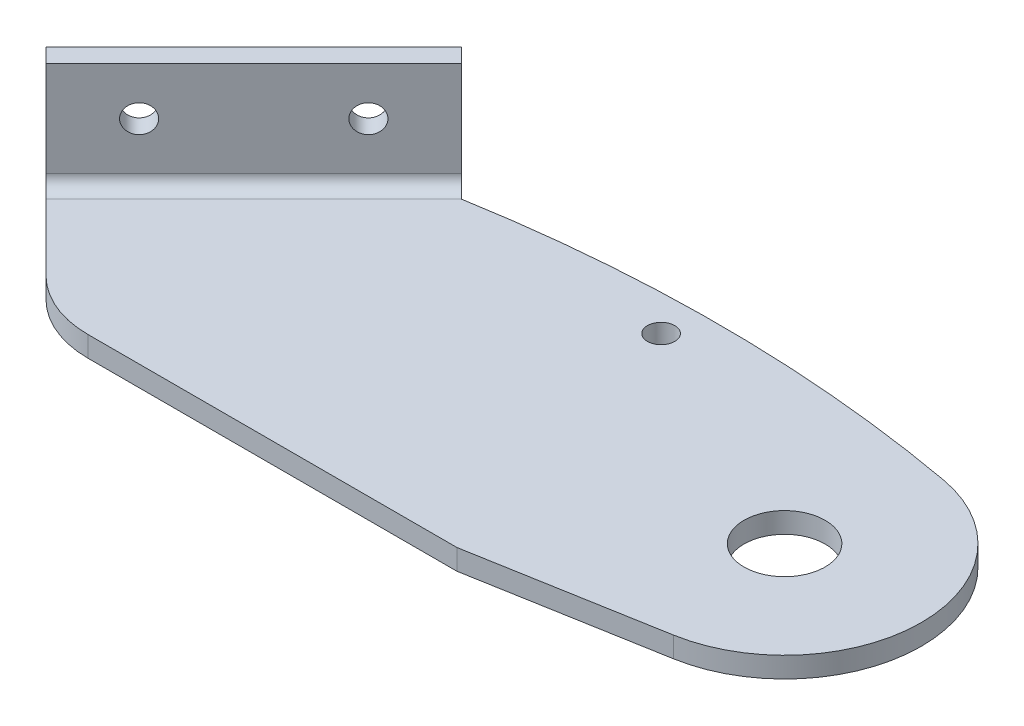
ISO-10303-21;
HEADER;
FILE_DESCRIPTION(('STEP AP214'),'2;1');
FILE_NAME('part.step','',(''),(''),'','','');
FILE_SCHEMA(('AUTOMOTIVE_DESIGN { 1 0 10303 214 1 1 1 1 }'));
ENDSEC;
DATA;
#1=APPLICATION_CONTEXT('core data for automotive mechanical design processes');
#2=APPLICATION_PROTOCOL_DEFINITION('international standard','automotive_design',2000,#1);
#3=PRODUCT_CONTEXT('',#1,'mechanical');
#4=PRODUCT('Part','Part','',(#3));
#5=PRODUCT_RELATED_PRODUCT_CATEGORY('part','',(#4));
#6=PRODUCT_DEFINITION_FORMATION('','',#4);
#7=PRODUCT_DEFINITION_CONTEXT('part definition',#1,'design');
#8=PRODUCT_DEFINITION('design','',#6,#7);
#9=PRODUCT_DEFINITION_SHAPE('','',#8);
#10=(LENGTH_UNIT() NAMED_UNIT(*) SI_UNIT(.MILLI.,.METRE.));
#11=(NAMED_UNIT(*) PLANE_ANGLE_UNIT() SI_UNIT($,.RADIAN.));
#12=(NAMED_UNIT(*) SI_UNIT($,.STERADIAN.) SOLID_ANGLE_UNIT());
#13=UNCERTAINTY_MEASURE_WITH_UNIT(LENGTH_MEASURE(1.E-05),#10,'distance_accuracy_value','');
#14=(GEOMETRIC_REPRESENTATION_CONTEXT(3) GLOBAL_UNCERTAINTY_ASSIGNED_CONTEXT((#13)) GLOBAL_UNIT_ASSIGNED_CONTEXT((#10,
#11,#12)) REPRESENTATION_CONTEXT('',''));
#15=CARTESIAN_POINT('',(0.,0.,0.));
#16=DIRECTION('',(0.,0.,1.));
#17=DIRECTION('',(1.,0.,0.));
#18=AXIS2_PLACEMENT_3D('',#15,#16,#17);
#19=CARTESIAN_POINT('',(14.5011314163777,7.968,-8.42031021678298));
#20=DIRECTION('',(-0.707106781186548,0.,-0.707106781186548));
#21=DIRECTION('',(-0.707106781186547,0.,0.707106781186548));
#22=AXIS2_PLACEMENT_3D('',#19,#20,#21);
#23=CYLINDRICAL_SURFACE('',#22,1.36525);
#24=CARTESIAN_POINT('',(11.6727042916315,7.968,-11.2487373415292));
#25=DIRECTION('',(-0.707106781186548,0.,-0.707106781186548));
#26=DIRECTION('',(-0.707106781186547,0.,0.707106781186548));
#27=AXIS2_PLACEMENT_3D('',#24,#25,#26);
#28=CIRCLE('',#27,1.36525);
#29=CARTESIAN_POINT('',(10.7073267586166,7.968,-10.2833598085142));
#30=VERTEX_POINT('',#29);
#31=EDGE_CURVE('E177',#30,#30,#28,.T.);
#32=ORIENTED_EDGE('',*,*,#31,.T.);
#33=EDGE_LOOP('',(#32));
#34=FACE_BOUND('',#33,.T.);
#35=CARTESIAN_POINT('',(13.1095452710026,7.968,-9.8118963621581));
#36=DIRECTION('',(-0.707106781186548,0.,-0.707106781186548));
#37=DIRECTION('',(-0.707106781186547,0.,0.707106781186548));
#38=AXIS2_PLACEMENT_3D('',#35,#36,#37);
#39=CIRCLE('',#38,1.36525);
#40=CARTESIAN_POINT('',(12.1441677379876,7.968,-8.84651882914316));
#41=VERTEX_POINT('',#40);
#42=EDGE_CURVE('E228',#41,#41,#39,.T.);
#43=ORIENTED_EDGE('',*,*,#42,.F.);
#44=EDGE_LOOP('',(#43));
#45=FACE_BOUND('',#44,.T.);
#46=ADVANCED_FACE('F50',(#34,#45),#23,.F.);
#47=CARTESIAN_POINT('',(3.18742291739294,7.968,2.89339828220179));
#48=DIRECTION('',(-0.707106781186548,0.,-0.707106781186548));
#49=DIRECTION('',(-0.707106781186547,0.,0.707106781186548));
#50=AXIS2_PLACEMENT_3D('',#47,#48,#49);
#51=CYLINDRICAL_SURFACE('',#50,1.36525);
#52=CARTESIAN_POINT('',(0.358995792646746,7.968,0.0649711574555981));
#53=DIRECTION('',(-0.707106781186548,0.,-0.707106781186548));
#54=DIRECTION('',(-0.707106781186547,0.,0.707106781186548));
#55=AXIS2_PLACEMENT_3D('',#52,#53,#54);
#56=CIRCLE('',#55,1.36525);
#57=CARTESIAN_POINT('',(-0.606381740368189,7.968,1.03034869047053));
#58=VERTEX_POINT('',#57);
#59=EDGE_CURVE('E247',#58,#58,#56,.T.);
#60=ORIENTED_EDGE('',*,*,#59,.T.);
#61=EDGE_LOOP('',(#60));
#62=FACE_BOUND('',#61,.T.);
#63=CARTESIAN_POINT('',(1.79583677201781,7.968,1.50181213682666));
#64=DIRECTION('',(-0.707106781186548,0.,-0.707106781186548));
#65=DIRECTION('',(-0.707106781186547,0.,0.707106781186548));
#66=AXIS2_PLACEMENT_3D('',#63,#64,#65);
#67=CIRCLE('',#66,1.36525);
#68=CARTESIAN_POINT('',(0.830459239002879,7.968,2.4671896698416));
#69=VERTEX_POINT('',#68);
#70=EDGE_CURVE('E233',#69,#69,#67,.T.);
#71=ORIENTED_EDGE('',*,*,#70,.F.);
#72=EDGE_LOOP('',(#71));
#73=FACE_BOUND('',#72,.T.);
#74=ADVANCED_FACE('F266',(#62,#73),#51,.F.);
#75=CARTESIAN_POINT('',(70.5718707373462,12.668,38.4580409487604));
#76=DIRECTION('',(0.,1.,0.));
#77=DIRECTION('',(-0.707106781186548,0.,0.707106781186548));
#78=AXIS2_PLACEMENT_3D('',#75,#76,#77);
#79=PLANE('',#78);
#80=DIRECTION('',(-0.707106781186548,0.,-0.707106781186548));
#81=VECTOR('',#80,1.);
#82=CARTESIAN_POINT('',(70.5718707373462,12.668,38.4580409487604));
#83=LINE('',#82,#81);
#84=CARTESIAN_POINT('',(17.7057393487151,12.668,-14.4080904398707));
#85=VERTEX_POINT('',#84);
#86=CARTESIAN_POINT('',(16.2688983693441,12.668,-15.8449314192417));
#87=VERTEX_POINT('',#86);
#88=EDGE_CURVE('E245',#85,#87,#83,.T.);
#89=ORIENTED_EDGE('',*,*,#88,.T.);
#90=DIRECTION('',(-0.707106781186547,0.,0.707106781186548));
#91=VECTOR('',#90,1.);
#92=CARTESIAN_POINT('',(16.2688983693441,12.668,-15.8449314192417));
#93=LINE('',#92,#91);
#94=CARTESIAN_POINT('',(-4.23719828506581,12.668,4.66116523516815));
#95=VERTEX_POINT('',#94);
#96=EDGE_CURVE('E158',#87,#95,#93,.T.);
#97=ORIENTED_EDGE('',*,*,#96,.T.);
#98=DIRECTION('',(-0.707106781186548,0.,-0.707106781186548));
#99=VECTOR('',#98,1.);
#100=CARTESIAN_POINT('',(50.0657740829363,12.668,58.9641376031703));
#101=LINE('',#100,#99);
#102=CARTESIAN_POINT('',(-2.80035730569474,12.668,6.09800621453923));
#103=VERTEX_POINT('',#102);
#104=EDGE_CURVE('E236',#103,#95,#101,.T.);
#105=ORIENTED_EDGE('',*,*,#104,.F.);
#106=DIRECTION('',(0.707106781186547,0.,-0.707106781186548));
#107=VECTOR('',#106,1.);
#108=CARTESIAN_POINT('',(17.7057393487151,12.668,-14.4080904398707));
#109=LINE('',#108,#107);
#110=EDGE_CURVE('E69',#103,#85,#109,.T.);
#111=ORIENTED_EDGE('',*,*,#110,.T.);
#112=EDGE_LOOP('',(#89,#97,#105,#111));
#113=FACE_BOUND('',#112,.T.);
#114=ADVANCED_FACE('F263',(#113),#79,.T.);
#115=CARTESIAN_POINT('',(70.5718707373462,12.668,38.4580409487604));
#116=DIRECTION('',(0.707106781186548,0.,-0.707106781186548));
#117=DIRECTION('',(0.,1.,0.));
#118=AXIS2_PLACEMENT_3D('',#115,#116,#117);
#119=PLANE('',#118);
#120=DIRECTION('',(-0.707106781186548,0.,-0.707106781186548));
#121=VECTOR('',#120,1.);
#122=CARTESIAN_POINT('',(70.5718707373462,3.27,38.4580409487604));
#123=LINE('',#122,#121);
#124=CARTESIAN_POINT('',(17.7057393487151,3.27000000000001,-14.4080904398707));
#125=VERTEX_POINT('',#124);
#126=CARTESIAN_POINT('',(16.268898369344,3.27000000000001,-15.8449314192417));
#127=VERTEX_POINT('',#126);
#128=EDGE_CURVE('E160',#125,#127,#123,.T.);
#129=ORIENTED_EDGE('',*,*,#128,.T.);
#130=DIRECTION('',(0.,1.,0.));
#131=VECTOR('',#130,1.);
#132=CARTESIAN_POINT('',(16.2688983693441,-0.0320000000000012,-15.8449314192417));
#133=LINE('',#132,#131);
#134=EDGE_CURVE('E94',#127,#87,#133,.T.);
#135=ORIENTED_EDGE('',*,*,#134,.T.);
#136=ORIENTED_EDGE('',*,*,#88,.F.);
#137=DIRECTION('',(0.,-1.,0.));
#138=VECTOR('',#137,1.);
#139=CARTESIAN_POINT('',(17.7057393487151,12.668,-14.4080904398707));
#140=LINE('',#139,#138);
#141=EDGE_CURVE('E159',#85,#125,#140,.T.);
#142=ORIENTED_EDGE('',*,*,#141,.T.);
#143=EDGE_LOOP('',(#129,#135,#136,#142));
#144=FACE_BOUND('',#143,.T.);
#145=ADVANCED_FACE('F164',(#144),#119,.T.);
#146=CARTESIAN_POINT('',(16.2688983693441,-0.0320000000000012,-15.8449314192417));
#147=DIRECTION('',(-0.707106781186547,0.,-0.707106781186548));
#148=DIRECTION('',(-0.707106781186548,0.,0.707106781186548));
#149=AXIS2_PLACEMENT_3D('',#146,#147,#148);
#150=PLANE('',#149);
#151=DIRECTION('',(0.707106781186548,0.,-0.707106781186547));
#152=VECTOR('',#151,1.);
#153=CARTESIAN_POINT('',(16.2688983693441,3.27,-15.8449314192417));
#154=LINE('',#153,#152);
#155=CARTESIAN_POINT('',(-4.23719828506581,3.27,4.66116523516816));
#156=VERTEX_POINT('',#155);
#157=EDGE_CURVE('E88',#156,#127,#154,.T.);
#158=ORIENTED_EDGE('',*,*,#157,.F.);
#159=DIRECTION('',(0.,1.,0.));
#160=VECTOR('',#159,1.);
#161=CARTESIAN_POINT('',(-4.23719828506581,12.668,4.66116523516816));
#162=LINE('',#161,#160);
#163=EDGE_CURVE('E238',#156,#95,#162,.T.);
#164=ORIENTED_EDGE('',*,*,#163,.T.);
#165=ORIENTED_EDGE('',*,*,#96,.F.);
#166=ORIENTED_EDGE('',*,*,#134,.F.);
#167=EDGE_LOOP('',(#158,#164,#165,#166));
#168=FACE_BOUND('',#167,.T.);
#169=ORIENTED_EDGE('',*,*,#59,.F.);
#170=EDGE_LOOP('',(#169));
#171=FACE_BOUND('',#170,.T.);
#172=ORIENTED_EDGE('',*,*,#31,.F.);
#173=EDGE_LOOP('',(#172));
#174=FACE_BOUND('',#173,.T.);
#175=ADVANCED_FACE('F155',(#168,#171,#174),#150,.T.);
#176=CARTESIAN_POINT('',(50.0657740829363,12.668,58.9641376031703));
#177=DIRECTION('',(0.707106781186548,0.,-0.707106781186548));
#178=DIRECTION('',(0.,1.,0.));
#179=AXIS2_PLACEMENT_3D('',#176,#177,#178);
#180=PLANE('',#179);
#181=ORIENTED_EDGE('',*,*,#163,.F.);
#182=DIRECTION('',(-0.707106781186548,0.,-0.707106781186548));
#183=VECTOR('',#182,1.);
#184=CARTESIAN_POINT('',(50.0657740829363,3.27,58.9641376031703));
#185=LINE('',#184,#183);
#186=CARTESIAN_POINT('',(-2.80035730569475,3.27,6.09800621453922));
#187=VERTEX_POINT('',#186);
#188=EDGE_CURVE('E54',#187,#156,#185,.T.);
#189=ORIENTED_EDGE('',*,*,#188,.F.);
#190=DIRECTION('',(0.,-1.,0.));
#191=VECTOR('',#190,1.);
#192=CARTESIAN_POINT('',(-2.80035730569474,12.668,6.09800621453922));
#193=LINE('',#192,#191);
#194=EDGE_CURVE('E60',#103,#187,#193,.T.);
#195=ORIENTED_EDGE('',*,*,#194,.F.);
#196=ORIENTED_EDGE('',*,*,#104,.T.);
#197=EDGE_LOOP('',(#181,#189,#195,#196));
#198=FACE_BOUND('',#197,.T.);
#199=ADVANCED_FACE('F256',(#198),#180,.F.);
#200=CARTESIAN_POINT('',(17.7057393487151,12.668,-14.4080904398707));
#201=DIRECTION('',(-0.707106781186548,0.,-0.707106781186548));
#202=DIRECTION('',(-0.707106781186547,0.,0.707106781186548));
#203=AXIS2_PLACEMENT_3D('',#200,#201,#202);
#204=PLANE('',#203);
#205=ORIENTED_EDGE('',*,*,#70,.T.);
#206=EDGE_LOOP('',(#205));
#207=FACE_BOUND('',#206,.T.);
#208=ORIENTED_EDGE('',*,*,#42,.T.);
#209=EDGE_LOOP('',(#208));
#210=FACE_BOUND('',#209,.T.);
#211=ORIENTED_EDGE('',*,*,#194,.T.);
#212=DIRECTION('',(0.707106781186548,0.,-0.707106781186548));
#213=VECTOR('',#212,1.);
#214=CARTESIAN_POINT('',(17.7057393487151,3.27,-14.4080904398706));
#215=LINE('',#214,#213);
#216=EDGE_CURVE('E13',#187,#125,#215,.T.);
#217=ORIENTED_EDGE('',*,*,#216,.T.);
#218=ORIENTED_EDGE('',*,*,#141,.F.);
#219=ORIENTED_EDGE('',*,*,#110,.F.);
#220=EDGE_LOOP('',(#211,#217,#218,#219));
#221=FACE_BOUND('',#220,.T.);
#222=ADVANCED_FACE('F52',(#207,#210,#221),#204,.F.);
#223=CARTESIAN_POINT('',(64.,-0.0319999999999999,0.));
#224=DIRECTION('',(0.,1.,0.));
#225=DIRECTION('',(0.,0.,1.));
#226=AXIS2_PLACEMENT_3D('',#223,#224,#225);
#227=PLANE('',#226);
#228=CARTESIAN_POINT('',(64.,-0.0319999999999999,0.));
#229=DIRECTION('',(0.,1.,0.));
#230=DIRECTION('',(0.,0.,-1.));
#231=AXIS2_PLACEMENT_3D('',#228,#229,#230);
#232=CIRCLE('',#231,4.);
#233=CARTESIAN_POINT('',(64.,-0.0319999999999999,-4.));
#234=VERTEX_POINT('',#233);
#235=EDGE_CURVE('E341',#234,#234,#232,.T.);
#236=ORIENTED_EDGE('',*,*,#235,.T.);
#237=EDGE_LOOP('',(#236));
#238=FACE_BOUND('',#237,.T.);
#239=CARTESIAN_POINT('',(39.9467553839433,-0.0319999999999999,-11.8675875071896));
#240=DIRECTION('',(0.,1.,0.));
#241=DIRECTION('',(0.,0.,1.));
#242=AXIS2_PLACEMENT_3D('',#239,#240,#241);
#243=CIRCLE('',#242,1.35255);
#244=CARTESIAN_POINT('',(39.9467553839433,-0.0319999999999999,-10.5150375071896));
#245=VERTEX_POINT('',#244);
#246=EDGE_CURVE('E338',#245,#245,#243,.T.);
#247=ORIENTED_EDGE('',*,*,#246,.T.);
#248=EDGE_LOOP('',(#247));
#249=FACE_BOUND('',#248,.T.);
#250=DIRECTION('',(-0.707106781186547,0.,0.707106781186548));
#251=VECTOR('',#250,1.);
#252=CARTESIAN_POINT('',(18.603764960822,-0.0320000000000042,-13.5100648277637));
#253=LINE('',#252,#251);
#254=CARTESIAN_POINT('',(18.603764960822,-0.0320000000000008,-13.5100648277637));
#255=VERTEX_POINT('',#254);
#256=CARTESIAN_POINT('',(-1.90233169358783,-0.031999999999999,6.99603182664614));
#257=VERTEX_POINT('',#256);
#258=EDGE_CURVE('E205',#255,#257,#253,.T.);
#259=ORIENTED_EDGE('',*,*,#258,.F.);
#260=DIRECTION('',(-0.707106781186547,0.,-0.707106781186548));
#261=VECTOR('',#260,1.);
#262=CARTESIAN_POINT('',(18.6138297885858,-0.0319999999999999,-13.5));
#263=LINE('',#262,#261);
#264=CARTESIAN_POINT('',(18.6138297885858,-0.0320000000000042,-13.5));
#265=VERTEX_POINT('',#264);
#266=EDGE_CURVE('E303',#265,#255,#263,.T.);
#267=ORIENTED_EDGE('',*,*,#266,.F.);
#268=CARTESIAN_POINT('',(41.9018097680888,-0.0319999999999999,121.082502881433));
#269=DIRECTION('',(0.,1.,0.));
#270=DIRECTION('',(0.,0.,-1.));
#271=AXIS2_PLACEMENT_3D('',#268,#269,#270);
#272=CIRCLE('',#271,136.582502881433);
#273=CARTESIAN_POINT('',(66.423785356544,-0.0319999999999999,-13.2806349451148));
#274=VERTEX_POINT('',#273);
#275=EDGE_CURVE('E306',#274,#265,#272,.T.);
#276=ORIENTED_EDGE('',*,*,#275,.F.);
#277=CARTESIAN_POINT('',(64.,-0.0319999999999999,0.));
#278=DIRECTION('',(0.,1.,0.));
#279=DIRECTION('',(0.,0.,1.));
#280=AXIS2_PLACEMENT_3D('',#277,#278,#279);
#281=CIRCLE('',#280,13.5);
#282=CARTESIAN_POINT('',(66.3442503985036,-0.0319999999999999,13.2949046656648));
#283=VERTEX_POINT('',#282);
#284=EDGE_CURVE('E309',#283,#274,#281,.T.);
#285=ORIENTED_EDGE('',*,*,#284,.F.);
#286=DIRECTION('',(0.984807753012208,0.,-0.173648177666931));
#287=VECTOR('',#286,1.);
#288=CARTESIAN_POINT('',(48.167251498747,-0.0319999999999999,16.5));
#289=LINE('',#288,#287);
#290=CARTESIAN_POINT('',(48.167251498747,-0.0319999999999999,16.5));
#291=VERTEX_POINT('',#290);
#292=EDGE_CURVE('E200',#291,#283,#289,.T.);
#293=ORIENTED_EDGE('',*,*,#292,.F.);
#294=DIRECTION('',(1.,0.,0.));
#295=VECTOR('',#294,1.);
#296=CARTESIAN_POINT('',(7.60163647976604,-0.0319999999999999,16.5));
#297=LINE('',#296,#295);
#298=CARTESIAN_POINT('',(11.743772103497,-0.0319999999999999,16.5));
#299=VERTEX_POINT('',#298);
#300=EDGE_CURVE('E344',#299,#291,#297,.T.);
#301=ORIENTED_EDGE('',*,*,#300,.F.);
#302=CARTESIAN_POINT('',(11.743772103497,-0.0319999999999999,6.5));
#303=DIRECTION('',(0.,1.,0.));
#304=DIRECTION('',(0.,0.,1.));
#305=AXIS2_PLACEMENT_3D('',#302,#303,#304);
#306=CIRCLE('',#305,10.);
#307=CARTESIAN_POINT('',(4.67270429163152,-0.0319999999999999,13.5710678118655));
#308=VERTEX_POINT('',#307);
#309=EDGE_CURVE('E311',#299,#308,#306,.F.);
#310=ORIENTED_EDGE('',*,*,#309,.T.);
#311=DIRECTION('',(0.707106781186548,0.,0.707106781186547));
#312=VECTOR('',#311,1.);
#313=CARTESIAN_POINT('',(-4.23719828506582,-0.0319999999999999,4.66116523516815));
#314=LINE('',#313,#312);
#315=EDGE_CURVE('E307',#257,#308,#314,.T.);
#316=ORIENTED_EDGE('',*,*,#315,.F.);
#317=EDGE_LOOP('',(#259,#267,#276,#285,#293,#301,#310,#316));
#318=FACE_BOUND('',#317,.T.);
#319=ADVANCED_FACE('F347',(#238,#249,#318),#227,.F.);
#320=CARTESIAN_POINT('',(64.,2.,0.));
#321=DIRECTION('',(0.,1.,0.));
#322=DIRECTION('',(0.,0.,1.));
#323=AXIS2_PLACEMENT_3D('',#320,#321,#322);
#324=PLANE('',#323);
#325=CARTESIAN_POINT('',(39.9467553839433,2.,-11.8675875071896));
#326=DIRECTION('',(0.,1.,0.));
#327=DIRECTION('',(0.,0.,1.));
#328=AXIS2_PLACEMENT_3D('',#325,#326,#327);
#329=CIRCLE('',#328,1.35255);
#330=CARTESIAN_POINT('',(39.9467553839433,2.,-10.5150375071896));
#331=VERTEX_POINT('',#330);
#332=EDGE_CURVE('E183',#331,#331,#329,.T.);
#333=ORIENTED_EDGE('',*,*,#332,.F.);
#334=EDGE_LOOP('',(#333));
#335=FACE_BOUND('',#334,.T.);
#336=CARTESIAN_POINT('',(64.,2.,0.));
#337=DIRECTION('',(0.,1.,0.));
#338=DIRECTION('',(0.,0.,-1.));
#339=AXIS2_PLACEMENT_3D('',#336,#337,#338);
#340=CIRCLE('',#339,4.);
#341=CARTESIAN_POINT('',(64.,2.,-4.));
#342=VERTEX_POINT('',#341);
#343=EDGE_CURVE('E333',#342,#342,#340,.T.);
#344=ORIENTED_EDGE('',*,*,#343,.F.);
#345=EDGE_LOOP('',(#344));
#346=FACE_BOUND('',#345,.T.);
#347=DIRECTION('',(-0.707106781186547,0.,-0.707106781186548));
#348=VECTOR('',#347,1.);
#349=CARTESIAN_POINT('',(18.6138297885858,2.,-13.5));
#350=LINE('',#349,#348);
#351=CARTESIAN_POINT('',(18.6138297885858,2.,-13.5));
#352=VERTEX_POINT('',#351);
#353=CARTESIAN_POINT('',(18.603764960822,2.,-13.5100648277637));
#354=VERTEX_POINT('',#353);
#355=EDGE_CURVE('E300',#352,#354,#350,.T.);
#356=ORIENTED_EDGE('',*,*,#355,.T.);
#357=DIRECTION('',(-0.707106781186547,0.,0.707106781186548));
#358=VECTOR('',#357,1.);
#359=CARTESIAN_POINT('',(18.603764960822,2.,-13.5100648277637));
#360=LINE('',#359,#358);
#361=CARTESIAN_POINT('',(-1.90233169358783,2.,6.99603182664614));
#362=VERTEX_POINT('',#361);
#363=EDGE_CURVE('E202',#354,#362,#360,.T.);
#364=ORIENTED_EDGE('',*,*,#363,.T.);
#365=DIRECTION('',(0.707106781186548,0.,0.707106781186547));
#366=VECTOR('',#365,1.);
#367=CARTESIAN_POINT('',(-4.23719828506582,2.,4.66116523516815));
#368=LINE('',#367,#366);
#369=CARTESIAN_POINT('',(4.67270429163152,2.,13.5710678118655));
#370=VERTEX_POINT('',#369);
#371=EDGE_CURVE('E192',#362,#370,#368,.T.);
#372=ORIENTED_EDGE('',*,*,#371,.T.);
#373=CARTESIAN_POINT('',(11.743772103497,2.,6.5));
#374=DIRECTION('',(0.,1.,0.));
#375=DIRECTION('',(0.,0.,1.));
#376=AXIS2_PLACEMENT_3D('',#373,#374,#375);
#377=CIRCLE('',#376,10.);
#378=CARTESIAN_POINT('',(11.743772103497,2.,16.5));
#379=VERTEX_POINT('',#378);
#380=EDGE_CURVE('E102',#370,#379,#377,.T.);
#381=ORIENTED_EDGE('',*,*,#380,.T.);
#382=DIRECTION('',(1.,0.,0.));
#383=VECTOR('',#382,1.);
#384=CARTESIAN_POINT('',(7.60163647976604,2.,16.5));
#385=LINE('',#384,#383);
#386=CARTESIAN_POINT('',(48.167251498747,2.,16.5));
#387=VERTEX_POINT('',#386);
#388=EDGE_CURVE('E110',#379,#387,#385,.T.);
#389=ORIENTED_EDGE('',*,*,#388,.T.);
#390=DIRECTION('',(0.984807753012208,0.,-0.173648177666931));
#391=VECTOR('',#390,1.);
#392=CARTESIAN_POINT('',(48.167251498747,2.,16.5));
#393=LINE('',#392,#391);
#394=CARTESIAN_POINT('',(66.3442503985036,2.,13.2949046656648));
#395=VERTEX_POINT('',#394);
#396=EDGE_CURVE('E327',#387,#395,#393,.T.);
#397=ORIENTED_EDGE('',*,*,#396,.T.);
#398=CARTESIAN_POINT('',(64.,2.,0.));
#399=DIRECTION('',(0.,1.,0.));
#400=DIRECTION('',(0.,0.,1.));
#401=AXIS2_PLACEMENT_3D('',#398,#399,#400);
#402=CIRCLE('',#401,13.5);
#403=CARTESIAN_POINT('',(66.423785356544,2.,-13.2806349451148));
#404=VERTEX_POINT('',#403);
#405=EDGE_CURVE('E325',#395,#404,#402,.T.);
#406=ORIENTED_EDGE('',*,*,#405,.T.);
#407=CARTESIAN_POINT('',(41.9018097680888,2.,121.082502881433));
#408=DIRECTION('',(0.,1.,0.));
#409=DIRECTION('',(0.,0.,-1.));
#410=AXIS2_PLACEMENT_3D('',#407,#408,#409);
#411=CIRCLE('',#410,136.582502881433);
#412=EDGE_CURVE('E326',#404,#352,#411,.T.);
#413=ORIENTED_EDGE('',*,*,#412,.T.);
#414=EDGE_LOOP('',(#356,#364,#372,#381,#389,#397,#406,#413));
#415=FACE_BOUND('',#414,.T.);
#416=ADVANCED_FACE('F297',(#335,#346,#415),#324,.T.);
#417=CARTESIAN_POINT('',(64.,-0.0319999999999999,0.));
#418=DIRECTION('',(0.,1.,0.));
#419=DIRECTION('',(0.,0.,1.));
#420=AXIS2_PLACEMENT_3D('',#417,#418,#419);
#421=CYLINDRICAL_SURFACE('',#420,4.);
#422=ORIENTED_EDGE('',*,*,#235,.F.);
#423=EDGE_LOOP('',(#422));
#424=FACE_BOUND('',#423,.T.);
#425=ORIENTED_EDGE('',*,*,#343,.T.);
#426=EDGE_LOOP('',(#425));
#427=FACE_BOUND('',#426,.T.);
#428=ADVANCED_FACE('F366',(#424,#427),#421,.F.);
#429=CARTESIAN_POINT('',(39.9467553839433,-1.,-11.8675875071896));
#430=DIRECTION('',(0.,1.,0.));
#431=DIRECTION('',(0.,0.,1.));
#432=AXIS2_PLACEMENT_3D('',#429,#430,#431);
#433=CYLINDRICAL_SURFACE('',#432,1.35255);
#434=ORIENTED_EDGE('',*,*,#332,.T.);
#435=EDGE_LOOP('',(#434));
#436=FACE_BOUND('',#435,.T.);
#437=ORIENTED_EDGE('',*,*,#246,.F.);
#438=EDGE_LOOP('',(#437));
#439=FACE_BOUND('',#438,.T.);
#440=ADVANCED_FACE('F369',(#436,#439),#433,.F.);
#441=CARTESIAN_POINT('',(18.6138297885858,171.184007176649,-13.5));
#442=DIRECTION('',(-0.707106781186548,0.,0.707106781186547));
#443=DIRECTION('',(0.707106781186547,0.,0.707106781186548));
#444=AXIS2_PLACEMENT_3D('',#441,#442,#443);
#445=PLANE('',#444);
#446=DIRECTION('',(0.,-1.,0.));
#447=VECTOR('',#446,1.);
#448=CARTESIAN_POINT('',(18.6138297885858,171.184007176649,-13.5));
#449=LINE('',#448,#447);
#450=EDGE_CURVE('E207',#352,#265,#449,.T.);
#451=ORIENTED_EDGE('',*,*,#450,.T.);
#452=ORIENTED_EDGE('',*,*,#266,.T.);
#453=DIRECTION('',(0.,-1.,0.));
#454=VECTOR('',#453,1.);
#455=CARTESIAN_POINT('',(18.603764960822,171.184007176649,-13.5100648277637));
#456=LINE('',#455,#454);
#457=EDGE_CURVE('E180',#354,#255,#456,.T.);
#458=ORIENTED_EDGE('',*,*,#457,.F.);
#459=ORIENTED_EDGE('',*,*,#355,.F.);
#460=EDGE_LOOP('',(#451,#452,#458,#459));
#461=FACE_BOUND('',#460,.T.);
#462=ADVANCED_FACE('F274',(#461),#445,.F.);
#463=CARTESIAN_POINT('',(-4.23719828506582,171.184007176649,4.66116523516815));
#464=DIRECTION('',(0.707106781186547,0.,-0.707106781186548));
#465=DIRECTION('',(-0.707106781186548,0.,-0.707106781186547));
#466=AXIS2_PLACEMENT_3D('',#463,#464,#465);
#467=PLANE('',#466);
#468=DIRECTION('',(0.,-1.,0.));
#469=VECTOR('',#468,1.);
#470=CARTESIAN_POINT('',(-1.90233169358783,171.184007176649,6.99603182664614));
#471=LINE('',#470,#469);
#472=EDGE_CURVE('E223',#362,#257,#471,.T.);
#473=ORIENTED_EDGE('',*,*,#472,.T.);
#474=ORIENTED_EDGE('',*,*,#315,.T.);
#475=DIRECTION('',(0.,-1.,0.));
#476=VECTOR('',#475,1.);
#477=CARTESIAN_POINT('',(4.67270429163152,171.184007176649,13.5710678118655));
#478=LINE('',#477,#476);
#479=EDGE_CURVE('E221',#370,#308,#478,.T.);
#480=ORIENTED_EDGE('',*,*,#479,.F.);
#481=ORIENTED_EDGE('',*,*,#371,.F.);
#482=EDGE_LOOP('',(#473,#474,#480,#481));
#483=FACE_BOUND('',#482,.T.);
#484=ADVANCED_FACE('F294',(#483),#467,.F.);
#485=CARTESIAN_POINT('',(11.743772103497,171.184007176649,6.5));
#486=DIRECTION('',(0.,-1.,0.));
#487=DIRECTION('',(0.,0.,-1.));
#488=AXIS2_PLACEMENT_3D('',#485,#486,#487);
#489=CYLINDRICAL_SURFACE('',#488,10.);
#490=ORIENTED_EDGE('',*,*,#479,.T.);
#491=ORIENTED_EDGE('',*,*,#309,.F.);
#492=DIRECTION('',(0.,-1.,0.));
#493=VECTOR('',#492,1.);
#494=CARTESIAN_POINT('',(11.743772103497,171.184007176649,16.5));
#495=LINE('',#494,#493);
#496=EDGE_CURVE('E219',#379,#299,#495,.T.);
#497=ORIENTED_EDGE('',*,*,#496,.F.);
#498=ORIENTED_EDGE('',*,*,#380,.F.);
#499=EDGE_LOOP('',(#490,#491,#497,#498));
#500=FACE_BOUND('',#499,.T.);
#501=ADVANCED_FACE('F348',(#500),#489,.T.);
#502=CARTESIAN_POINT('',(7.60163647976604,171.184007176649,16.5));
#503=DIRECTION('',(0.,0.,-1.));
#504=DIRECTION('',(-1.,0.,0.));
#505=AXIS2_PLACEMENT_3D('',#502,#503,#504);
#506=PLANE('',#505);
#507=ORIENTED_EDGE('',*,*,#496,.T.);
#508=ORIENTED_EDGE('',*,*,#300,.T.);
#509=DIRECTION('',(0.,-1.,0.));
#510=VECTOR('',#509,1.);
#511=CARTESIAN_POINT('',(48.167251498747,171.184007176649,16.5));
#512=LINE('',#511,#510);
#513=EDGE_CURVE('E216',#387,#291,#512,.T.);
#514=ORIENTED_EDGE('',*,*,#513,.F.);
#515=ORIENTED_EDGE('',*,*,#388,.F.);
#516=EDGE_LOOP('',(#507,#508,#514,#515));
#517=FACE_BOUND('',#516,.T.);
#518=ADVANCED_FACE('F350',(#517),#506,.F.);
#519=CARTESIAN_POINT('',(48.167251498747,171.184007176649,16.5));
#520=DIRECTION('',(-0.173648177666931,0.,-0.984807753012208));
#521=DIRECTION('',(-0.984807753012208,0.,0.173648177666931));
#522=AXIS2_PLACEMENT_3D('',#519,#520,#521);
#523=PLANE('',#522);
#524=ORIENTED_EDGE('',*,*,#513,.T.);
#525=ORIENTED_EDGE('',*,*,#292,.T.);
#526=DIRECTION('',(0.,-1.,0.));
#527=VECTOR('',#526,1.);
#528=CARTESIAN_POINT('',(66.3442503985036,171.184007176649,13.2949046656648));
#529=LINE('',#528,#527);
#530=EDGE_CURVE('E213',#395,#283,#529,.T.);
#531=ORIENTED_EDGE('',*,*,#530,.F.);
#532=ORIENTED_EDGE('',*,*,#396,.F.);
#533=EDGE_LOOP('',(#524,#525,#531,#532));
#534=FACE_BOUND('',#533,.T.);
#535=ADVANCED_FACE('F320',(#534),#523,.F.);
#536=CARTESIAN_POINT('',(64.,171.184007176649,0.));
#537=DIRECTION('',(0.,-1.,0.));
#538=DIRECTION('',(0.,0.,-1.));
#539=AXIS2_PLACEMENT_3D('',#536,#537,#538);
#540=CYLINDRICAL_SURFACE('',#539,13.5);
#541=ORIENTED_EDGE('',*,*,#530,.T.);
#542=ORIENTED_EDGE('',*,*,#284,.T.);
#543=DIRECTION('',(0.,-1.,0.));
#544=VECTOR('',#543,1.);
#545=CARTESIAN_POINT('',(66.423785356544,171.184007176649,-13.2806349451148));
#546=LINE('',#545,#544);
#547=EDGE_CURVE('E210',#404,#274,#546,.T.);
#548=ORIENTED_EDGE('',*,*,#547,.F.);
#549=ORIENTED_EDGE('',*,*,#405,.F.);
#550=EDGE_LOOP('',(#541,#542,#548,#549));
#551=FACE_BOUND('',#550,.T.);
#552=ADVANCED_FACE('F323',(#551),#540,.T.);
#553=CARTESIAN_POINT('',(41.9018097680888,171.184007176649,121.082502881433));
#554=DIRECTION('',(0.,-1.,0.));
#555=DIRECTION('',(0.,0.,-1.));
#556=AXIS2_PLACEMENT_3D('',#553,#554,#555);
#557=CYLINDRICAL_SURFACE('',#556,136.582502881433);
#558=ORIENTED_EDGE('',*,*,#547,.T.);
#559=ORIENTED_EDGE('',*,*,#275,.T.);
#560=ORIENTED_EDGE('',*,*,#450,.F.);
#561=ORIENTED_EDGE('',*,*,#412,.F.);
#562=EDGE_LOOP('',(#558,#559,#560,#561));
#563=FACE_BOUND('',#562,.T.);
#564=ADVANCED_FACE('F362',(#563),#557,.T.);
#565=CARTESIAN_POINT('',(-1.90233169358783,3.27,6.99603182664614));
#566=DIRECTION('',(-0.707106781186547,0.,0.707106781186548));
#567=DIRECTION('',(0.707106781186548,0.,0.707106781186547));
#568=AXIS2_PLACEMENT_3D('',#565,#566,#567);
#569=PLANE('',#568);
#570=ORIENTED_EDGE('',*,*,#472,.F.);
#571=CARTESIAN_POINT('',(-1.90233169358783,3.27,6.99603182664614));
#572=DIRECTION('',(-0.707106781186547,0.,0.707106781186548));
#573=DIRECTION('',(0.707106781186548,0.,0.707106781186547));
#574=AXIS2_PLACEMENT_3D('',#571,#572,#573);
#575=CIRCLE('',#574,1.27);
#576=EDGE_CURVE('E181',#362,#187,#575,.F.);
#577=ORIENTED_EDGE('',*,*,#576,.T.);
#578=ORIENTED_EDGE('',*,*,#188,.T.);
#579=CARTESIAN_POINT('',(-1.90233169358783,3.27,6.99603182664614));
#580=DIRECTION('',(-0.707106781186547,0.,0.707106781186548));
#581=DIRECTION('',(0.707106781186548,0.,0.707106781186547));
#582=AXIS2_PLACEMENT_3D('',#579,#580,#581);
#583=CIRCLE('',#582,3.302);
#584=EDGE_CURVE('E176',#257,#156,#583,.F.);
#585=ORIENTED_EDGE('',*,*,#584,.F.);
#586=EDGE_LOOP('',(#570,#577,#578,#585));
#587=FACE_BOUND('',#586,.T.);
#588=ADVANCED_FACE('F290',(#587),#569,.T.);
#589=CARTESIAN_POINT('',(18.603764960822,3.27,-13.5100648277637));
#590=DIRECTION('',(0.707106781186548,0.,-0.707106781186547));
#591=DIRECTION('',(-0.707106781186547,0.,-0.707106781186548));
#592=AXIS2_PLACEMENT_3D('',#589,#590,#591);
#593=PLANE('',#592);
#594=ORIENTED_EDGE('',*,*,#128,.F.);
#595=CARTESIAN_POINT('',(18.603764960822,3.27,-13.5100648277637));
#596=DIRECTION('',(-0.707106781186547,0.,0.707106781186548));
#597=DIRECTION('',(0.707106781186548,0.,0.707106781186547));
#598=AXIS2_PLACEMENT_3D('',#595,#596,#597);
#599=CIRCLE('',#598,1.27);
#600=EDGE_CURVE('E186',#125,#354,#599,.T.);
#601=ORIENTED_EDGE('',*,*,#600,.T.);
#602=ORIENTED_EDGE('',*,*,#457,.T.);
#603=CARTESIAN_POINT('',(18.603764960822,3.27,-13.5100648277637));
#604=DIRECTION('',(-0.707106781186547,0.,0.707106781186548));
#605=DIRECTION('',(0.707106781186548,0.,0.707106781186547));
#606=AXIS2_PLACEMENT_3D('',#603,#604,#605);
#607=CIRCLE('',#606,3.302);
#608=EDGE_CURVE('E174',#127,#255,#607,.T.);
#609=ORIENTED_EDGE('',*,*,#608,.F.);
#610=EDGE_LOOP('',(#594,#601,#602,#609));
#611=FACE_BOUND('',#610,.T.);
#612=ADVANCED_FACE('F178',(#611),#593,.T.);
#613=CARTESIAN_POINT('',(86.9060003079776,3.26999999999999,-81.8123001749193));
#614=DIRECTION('',(-0.707106781186547,0.,0.707106781186548));
#615=DIRECTION('',(0.707106781186548,0.,0.707106781186547));
#616=AXIS2_PLACEMENT_3D('',#613,#614,#615);
#617=CYLINDRICAL_SURFACE('',#616,3.302);
#618=ORIENTED_EDGE('',*,*,#608,.T.);
#619=ORIENTED_EDGE('',*,*,#258,.T.);
#620=ORIENTED_EDGE('',*,*,#584,.T.);
#621=ORIENTED_EDGE('',*,*,#157,.T.);
#622=EDGE_LOOP('',(#618,#619,#620,#621));
#623=FACE_BOUND('',#622,.T.);
#624=ADVANCED_FACE('F172',(#623),#617,.T.);
#625=CARTESIAN_POINT('',(86.9060003079776,3.26999999999999,-81.8123001749193));
#626=DIRECTION('',(-0.707106781186547,0.,0.707106781186548));
#627=DIRECTION('',(0.707106781186548,0.,0.707106781186547));
#628=AXIS2_PLACEMENT_3D('',#625,#626,#627);
#629=CYLINDRICAL_SURFACE('',#628,1.27);
#630=ORIENTED_EDGE('',*,*,#600,.F.);
#631=ORIENTED_EDGE('',*,*,#216,.F.);
#632=ORIENTED_EDGE('',*,*,#576,.F.);
#633=ORIENTED_EDGE('',*,*,#363,.F.);
#634=EDGE_LOOP('',(#630,#631,#632,#633));
#635=FACE_BOUND('',#634,.T.);
#636=ADVANCED_FACE('F286',(#635),#629,.F.);
#637=CLOSED_SHELL('',(#46,#74,#114,#145,#175,#199,#222,#319,#416,#428,#440,#462,#484,#501,#518,
#535,#552,#564,#588,#612,#624,#636));
#638=MANIFOLD_SOLID_BREP('B2',#637);
#639=ADVANCED_BREP_SHAPE_REPRESENTATION('',(#18,#638),#14);
#640=SHAPE_DEFINITION_REPRESENTATION(#9,#639);
ENDSEC;
END-ISO-10303-21;
